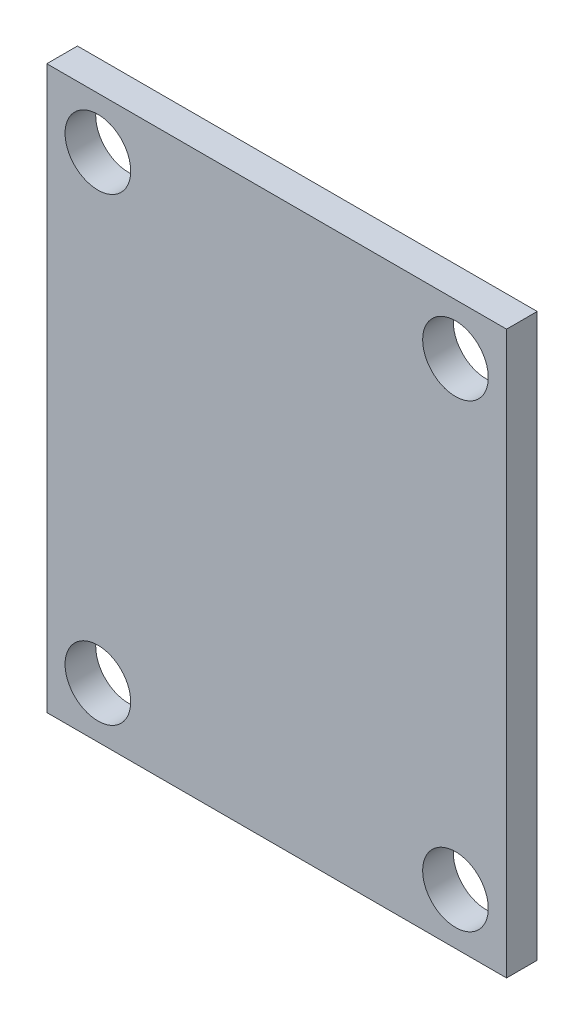
ISO-10303-21;
HEADER;
FILE_DESCRIPTION(('STEP AP214'),'2;1');
FILE_NAME('part.step','',(''),(''),'','','');
FILE_SCHEMA(('AUTOMOTIVE_DESIGN { 1 0 10303 214 1 1 1 1 }'));
ENDSEC;
DATA;
#1=APPLICATION_CONTEXT('core data for automotive mechanical design processes');
#2=APPLICATION_PROTOCOL_DEFINITION('international standard','automotive_design',2000,#1);
#3=PRODUCT_CONTEXT('',#1,'mechanical');
#4=PRODUCT('Part','Part','',(#3));
#5=PRODUCT_RELATED_PRODUCT_CATEGORY('part','',(#4));
#6=PRODUCT_DEFINITION_FORMATION('','',#4);
#7=PRODUCT_DEFINITION_CONTEXT('part definition',#1,'design');
#8=PRODUCT_DEFINITION('design','',#6,#7);
#9=PRODUCT_DEFINITION_SHAPE('','',#8);
#10=(LENGTH_UNIT() NAMED_UNIT(*) SI_UNIT(.MILLI.,.METRE.));
#11=(NAMED_UNIT(*) PLANE_ANGLE_UNIT() SI_UNIT($,.RADIAN.));
#12=(NAMED_UNIT(*) SI_UNIT($,.STERADIAN.) SOLID_ANGLE_UNIT());
#13=UNCERTAINTY_MEASURE_WITH_UNIT(LENGTH_MEASURE(1.E-05),#10,'distance_accuracy_value','');
#14=(GEOMETRIC_REPRESENTATION_CONTEXT(3) GLOBAL_UNCERTAINTY_ASSIGNED_CONTEXT((#13)) GLOBAL_UNIT_ASSIGNED_CONTEXT((#10,
#11,#12)) REPRESENTATION_CONTEXT('',''));
#15=CARTESIAN_POINT('',(0.,0.,0.));
#16=DIRECTION('',(0.,0.,1.));
#17=DIRECTION('',(1.,0.,0.));
#18=AXIS2_PLACEMENT_3D('',#15,#16,#17);
#19=CARTESIAN_POINT('',(11.43,-13.97,-1.524));
#20=DIRECTION('',(0.,0.,-1.));
#21=DIRECTION('',(1.,0.,0.));
#22=AXIS2_PLACEMENT_3D('',#19,#20,#21);
#23=PLANE('',#22);
#24=CARTESIAN_POINT('',(8.89,-11.43,-1.524));
#25=DIRECTION('',(0.,0.,1.));
#26=DIRECTION('',(1.,0.,0.));
#27=AXIS2_PLACEMENT_3D('',#24,#25,#26);
#28=CIRCLE('',#27,1.63195);
#29=CARTESIAN_POINT('',(7.25805,-11.43,-1.524));
#30=VERTEX_POINT('',#29);
#31=EDGE_CURVE('E117',#30,#30,#28,.T.);
#32=ORIENTED_EDGE('',*,*,#31,.T.);
#33=EDGE_LOOP('',(#32));
#34=FACE_BOUND('',#33,.T.);
#35=CARTESIAN_POINT('',(-8.89,11.43,-1.524));
#36=DIRECTION('',(0.,0.,1.));
#37=DIRECTION('',(1.,0.,0.));
#38=AXIS2_PLACEMENT_3D('',#35,#36,#37);
#39=CIRCLE('',#38,1.63195);
#40=CARTESIAN_POINT('',(-10.52195,11.43,-1.524));
#41=VERTEX_POINT('',#40);
#42=EDGE_CURVE('E100',#41,#41,#39,.T.);
#43=ORIENTED_EDGE('',*,*,#42,.T.);
#44=EDGE_LOOP('',(#43));
#45=FACE_BOUND('',#44,.T.);
#46=DIRECTION('',(0.,1.,0.));
#47=VECTOR('',#46,1.);
#48=CARTESIAN_POINT('',(11.43,13.97,-1.524));
#49=LINE('',#48,#47);
#50=CARTESIAN_POINT('',(11.43,-13.97,-1.524));
#51=VERTEX_POINT('',#50);
#52=CARTESIAN_POINT('',(11.43,13.97,-1.524));
#53=VERTEX_POINT('',#52);
#54=EDGE_CURVE('E88',#51,#53,#49,.T.);
#55=ORIENTED_EDGE('',*,*,#54,.F.);
#56=DIRECTION('',(1.,0.,0.));
#57=VECTOR('',#56,1.);
#58=CARTESIAN_POINT('',(-11.43,-13.97,-1.524));
#59=LINE('',#58,#57);
#60=CARTESIAN_POINT('',(-11.43,-13.97,-1.524));
#61=VERTEX_POINT('',#60);
#62=EDGE_CURVE('E91',#61,#51,#59,.T.);
#63=ORIENTED_EDGE('',*,*,#62,.F.);
#64=DIRECTION('',(0.,-1.,0.));
#65=VECTOR('',#64,1.);
#66=CARTESIAN_POINT('',(-11.43,13.97,-1.524));
#67=LINE('',#66,#65);
#68=CARTESIAN_POINT('',(-11.43,13.97,-1.524));
#69=VERTEX_POINT('',#68);
#70=EDGE_CURVE('E79',#69,#61,#67,.T.);
#71=ORIENTED_EDGE('',*,*,#70,.F.);
#72=DIRECTION('',(-1.,0.,0.));
#73=VECTOR('',#72,1.);
#74=CARTESIAN_POINT('',(-11.43,13.97,-1.524));
#75=LINE('',#74,#73);
#76=EDGE_CURVE('E84',#53,#69,#75,.T.);
#77=ORIENTED_EDGE('',*,*,#76,.F.);
#78=EDGE_LOOP('',(#55,#63,#71,#77));
#79=FACE_BOUND('',#78,.T.);
#80=CARTESIAN_POINT('',(8.89,11.43,-1.524));
#81=DIRECTION('',(0.,0.,1.));
#82=DIRECTION('',(1.,0.,0.));
#83=AXIS2_PLACEMENT_3D('',#80,#81,#82);
#84=CIRCLE('',#83,1.63195);
#85=CARTESIAN_POINT('',(7.25805,11.43,-1.524));
#86=VERTEX_POINT('',#85);
#87=EDGE_CURVE('E111',#86,#86,#84,.T.);
#88=ORIENTED_EDGE('',*,*,#87,.T.);
#89=EDGE_LOOP('',(#88));
#90=FACE_BOUND('',#89,.T.);
#91=CARTESIAN_POINT('',(-8.89,-11.43,-1.524));
#92=DIRECTION('',(0.,0.,1.));
#93=DIRECTION('',(1.,0.,0.));
#94=AXIS2_PLACEMENT_3D('',#91,#92,#93);
#95=CIRCLE('',#94,1.63195);
#96=CARTESIAN_POINT('',(-10.52195,-11.43,-1.524));
#97=VERTEX_POINT('',#96);
#98=EDGE_CURVE('E123',#97,#97,#95,.T.);
#99=ORIENTED_EDGE('',*,*,#98,.T.);
#100=EDGE_LOOP('',(#99));
#101=FACE_BOUND('',#100,.T.);
#102=ADVANCED_FACE('F32',(#34,#45,#79,#90,#101),#23,.T.);
#103=CARTESIAN_POINT('',(11.43,-13.97,0.));
#104=DIRECTION('',(0.,0.,-1.));
#105=DIRECTION('',(1.,0.,0.));
#106=AXIS2_PLACEMENT_3D('',#103,#104,#105);
#107=PLANE('',#106);
#108=CARTESIAN_POINT('',(8.89,-11.43,0.));
#109=DIRECTION('',(0.,0.,1.));
#110=DIRECTION('',(1.,0.,0.));
#111=AXIS2_PLACEMENT_3D('',#108,#109,#110);
#112=CIRCLE('',#111,1.63195);
#113=CARTESIAN_POINT('',(7.25805,-11.43,0.));
#114=VERTEX_POINT('',#113);
#115=EDGE_CURVE('E120',#114,#114,#112,.T.);
#116=ORIENTED_EDGE('',*,*,#115,.F.);
#117=EDGE_LOOP('',(#116));
#118=FACE_BOUND('',#117,.T.);
#119=CARTESIAN_POINT('',(-8.89,11.43,0.));
#120=DIRECTION('',(0.,0.,1.));
#121=DIRECTION('',(1.,0.,0.));
#122=AXIS2_PLACEMENT_3D('',#119,#120,#121);
#123=CIRCLE('',#122,1.63195);
#124=CARTESIAN_POINT('',(-10.52195,11.43,0.));
#125=VERTEX_POINT('',#124);
#126=EDGE_CURVE('E108',#125,#125,#123,.T.);
#127=ORIENTED_EDGE('',*,*,#126,.F.);
#128=EDGE_LOOP('',(#127));
#129=FACE_BOUND('',#128,.T.);
#130=DIRECTION('',(0.,1.,0.));
#131=VECTOR('',#130,1.);
#132=CARTESIAN_POINT('',(11.43,13.97,0.));
#133=LINE('',#132,#131);
#134=CARTESIAN_POINT('',(11.43,-13.97,0.));
#135=VERTEX_POINT('',#134);
#136=CARTESIAN_POINT('',(11.43,13.97,0.));
#137=VERTEX_POINT('',#136);
#138=EDGE_CURVE('E96',#135,#137,#133,.T.);
#139=ORIENTED_EDGE('',*,*,#138,.T.);
#140=DIRECTION('',(-1.,0.,0.));
#141=VECTOR('',#140,1.);
#142=CARTESIAN_POINT('',(-11.43,13.97,0.));
#143=LINE('',#142,#141);
#144=CARTESIAN_POINT('',(-11.43,13.97,0.));
#145=VERTEX_POINT('',#144);
#146=EDGE_CURVE('E99',#137,#145,#143,.T.);
#147=ORIENTED_EDGE('',*,*,#146,.T.);
#148=DIRECTION('',(0.,-1.,0.));
#149=VECTOR('',#148,1.);
#150=CARTESIAN_POINT('',(-11.43,13.97,0.));
#151=LINE('',#150,#149);
#152=CARTESIAN_POINT('',(-11.43,-13.97,0.));
#153=VERTEX_POINT('',#152);
#154=EDGE_CURVE('E82',#145,#153,#151,.T.);
#155=ORIENTED_EDGE('',*,*,#154,.T.);
#156=DIRECTION('',(1.,0.,0.));
#157=VECTOR('',#156,1.);
#158=CARTESIAN_POINT('',(-11.43,-13.97,0.));
#159=LINE('',#158,#157);
#160=EDGE_CURVE('E103',#153,#135,#159,.T.);
#161=ORIENTED_EDGE('',*,*,#160,.T.);
#162=EDGE_LOOP('',(#139,#147,#155,#161));
#163=FACE_BOUND('',#162,.T.);
#164=CARTESIAN_POINT('',(8.89,11.43,0.));
#165=DIRECTION('',(0.,0.,1.));
#166=DIRECTION('',(1.,0.,0.));
#167=AXIS2_PLACEMENT_3D('',#164,#165,#166);
#168=CIRCLE('',#167,1.63195);
#169=CARTESIAN_POINT('',(7.25805,11.43,0.));
#170=VERTEX_POINT('',#169);
#171=EDGE_CURVE('E114',#170,#170,#168,.T.);
#172=ORIENTED_EDGE('',*,*,#171,.F.);
#173=EDGE_LOOP('',(#172));
#174=FACE_BOUND('',#173,.T.);
#175=CARTESIAN_POINT('',(-8.89,-11.43,0.));
#176=DIRECTION('',(0.,0.,1.));
#177=DIRECTION('',(1.,0.,0.));
#178=AXIS2_PLACEMENT_3D('',#175,#176,#177);
#179=CIRCLE('',#178,1.63195);
#180=CARTESIAN_POINT('',(-10.52195,-11.43,0.));
#181=VERTEX_POINT('',#180);
#182=EDGE_CURVE('E126',#181,#181,#179,.T.);
#183=ORIENTED_EDGE('',*,*,#182,.F.);
#184=EDGE_LOOP('',(#183));
#185=FACE_BOUND('',#184,.T.);
#186=ADVANCED_FACE('F140',(#118,#129,#163,#174,#185),#107,.F.);
#187=CARTESIAN_POINT('',(11.43,13.97,-1.524));
#188=DIRECTION('',(-1.,0.,0.));
#189=DIRECTION('',(0.,-1.,0.));
#190=AXIS2_PLACEMENT_3D('',#187,#188,#189);
#191=PLANE('',#190);
#192=ORIENTED_EDGE('',*,*,#138,.F.);
#193=DIRECTION('',(0.,0.,1.));
#194=VECTOR('',#193,1.);
#195=CARTESIAN_POINT('',(11.43,-13.97,-1.524));
#196=LINE('',#195,#194);
#197=EDGE_CURVE('E49',#51,#135,#196,.T.);
#198=ORIENTED_EDGE('',*,*,#197,.F.);
#199=ORIENTED_EDGE('',*,*,#54,.T.);
#200=DIRECTION('',(0.,0.,1.));
#201=VECTOR('',#200,1.);
#202=CARTESIAN_POINT('',(11.43,13.97,-1.524));
#203=LINE('',#202,#201);
#204=EDGE_CURVE('E11',#53,#137,#203,.T.);
#205=ORIENTED_EDGE('',*,*,#204,.T.);
#206=EDGE_LOOP('',(#192,#198,#199,#205));
#207=FACE_BOUND('',#206,.T.);
#208=ADVANCED_FACE('F34',(#207),#191,.F.);
#209=CARTESIAN_POINT('',(-11.43,13.97,-1.524));
#210=DIRECTION('',(0.,-1.,0.));
#211=DIRECTION('',(0.,0.,1.));
#212=AXIS2_PLACEMENT_3D('',#209,#210,#211);
#213=PLANE('',#212);
#214=ORIENTED_EDGE('',*,*,#146,.F.);
#215=ORIENTED_EDGE('',*,*,#204,.F.);
#216=ORIENTED_EDGE('',*,*,#76,.T.);
#217=DIRECTION('',(0.,0.,1.));
#218=VECTOR('',#217,1.);
#219=CARTESIAN_POINT('',(-11.43,13.97,-1.524));
#220=LINE('',#219,#218);
#221=EDGE_CURVE('E41',#69,#145,#220,.T.);
#222=ORIENTED_EDGE('',*,*,#221,.T.);
#223=EDGE_LOOP('',(#214,#215,#216,#222));
#224=FACE_BOUND('',#223,.T.);
#225=ADVANCED_FACE('F85',(#224),#213,.F.);
#226=CARTESIAN_POINT('',(-11.43,13.97,-1.524));
#227=DIRECTION('',(1.,0.,0.));
#228=DIRECTION('',(0.,0.,1.));
#229=AXIS2_PLACEMENT_3D('',#226,#227,#228);
#230=PLANE('',#229);
#231=ORIENTED_EDGE('',*,*,#154,.F.);
#232=ORIENTED_EDGE('',*,*,#221,.F.);
#233=ORIENTED_EDGE('',*,*,#70,.T.);
#234=DIRECTION('',(0.,0.,1.));
#235=VECTOR('',#234,1.);
#236=CARTESIAN_POINT('',(-11.43,-13.97,-1.524));
#237=LINE('',#236,#235);
#238=EDGE_CURVE('E65',#61,#153,#237,.T.);
#239=ORIENTED_EDGE('',*,*,#238,.T.);
#240=EDGE_LOOP('',(#231,#232,#233,#239));
#241=FACE_BOUND('',#240,.T.);
#242=ADVANCED_FACE('F77',(#241),#230,.F.);
#243=CARTESIAN_POINT('',(-11.43,-13.97,-1.524));
#244=DIRECTION('',(0.,1.,0.));
#245=DIRECTION('',(0.,0.,-1.));
#246=AXIS2_PLACEMENT_3D('',#243,#244,#245);
#247=PLANE('',#246);
#248=ORIENTED_EDGE('',*,*,#160,.F.);
#249=ORIENTED_EDGE('',*,*,#238,.F.);
#250=ORIENTED_EDGE('',*,*,#62,.T.);
#251=ORIENTED_EDGE('',*,*,#197,.T.);
#252=EDGE_LOOP('',(#248,#249,#250,#251));
#253=FACE_BOUND('',#252,.T.);
#254=ADVANCED_FACE('F154',(#253),#247,.F.);
#255=CARTESIAN_POINT('',(-8.89,11.43,-1.524));
#256=DIRECTION('',(0.,0.,1.));
#257=DIRECTION('',(-1.,0.,0.));
#258=AXIS2_PLACEMENT_3D('',#255,#256,#257);
#259=CYLINDRICAL_SURFACE('',#258,1.63195);
#260=CARTESIAN_POINT('',(-10.52195,11.43,-1.524));
#261=CARTESIAN_POINT('',(-10.52195,11.43,-1.508125));
#262=CARTESIAN_POINT('',(-10.52195,11.43,-1.49225));
#263=CARTESIAN_POINT('',(-10.52195,11.43,-1.4605));
#264=CARTESIAN_POINT('',(-10.52195,11.43,-1.444625));
#265=CARTESIAN_POINT('',(-10.52195,11.43,-1.412875));
#266=CARTESIAN_POINT('',(-10.52195,11.43,-1.397));
#267=CARTESIAN_POINT('',(-10.52195,11.43,-1.36525));
#268=CARTESIAN_POINT('',(-10.52195,11.43,-1.349375));
#269=CARTESIAN_POINT('',(-10.52195,11.43,-1.317625));
#270=CARTESIAN_POINT('',(-10.52195,11.43,-1.30175));
#271=CARTESIAN_POINT('',(-10.52195,11.43,-1.27));
#272=CARTESIAN_POINT('',(-10.52195,11.43,-1.254125));
#273=CARTESIAN_POINT('',(-10.52195,11.43,-1.222375));
#274=CARTESIAN_POINT('',(-10.52195,11.43,-1.2065));
#275=CARTESIAN_POINT('',(-10.52195,11.43,-1.17475));
#276=CARTESIAN_POINT('',(-10.52195,11.43,-1.158875));
#277=CARTESIAN_POINT('',(-10.52195,11.43,-1.127125));
#278=CARTESIAN_POINT('',(-10.52195,11.43,-1.11125));
#279=CARTESIAN_POINT('',(-10.52195,11.43,-1.0795));
#280=CARTESIAN_POINT('',(-10.52195,11.43,-1.063625));
#281=CARTESIAN_POINT('',(-10.52195,11.43,-1.031875));
#282=CARTESIAN_POINT('',(-10.52195,11.43,-1.016));
#283=CARTESIAN_POINT('',(-10.52195,11.43,-0.98425));
#284=CARTESIAN_POINT('',(-10.52195,11.43,-0.968375));
#285=CARTESIAN_POINT('',(-10.52195,11.43,-0.936625));
#286=CARTESIAN_POINT('',(-10.52195,11.43,-0.92075));
#287=CARTESIAN_POINT('',(-10.52195,11.43,-0.889));
#288=CARTESIAN_POINT('',(-10.52195,11.43,-0.873125));
#289=CARTESIAN_POINT('',(-10.52195,11.43,-0.841375));
#290=CARTESIAN_POINT('',(-10.52195,11.43,-0.8255));
#291=CARTESIAN_POINT('',(-10.52195,11.43,-0.79375));
#292=CARTESIAN_POINT('',(-10.52195,11.43,-0.777875));
#293=CARTESIAN_POINT('',(-10.52195,11.43,-0.746125));
#294=CARTESIAN_POINT('',(-10.52195,11.43,-0.73025));
#295=CARTESIAN_POINT('',(-10.52195,11.43,-0.6985));
#296=CARTESIAN_POINT('',(-10.52195,11.43,-0.682625));
#297=CARTESIAN_POINT('',(-10.52195,11.43,-0.650875));
#298=CARTESIAN_POINT('',(-10.52195,11.43,-0.635));
#299=CARTESIAN_POINT('',(-10.52195,11.43,-0.60325));
#300=CARTESIAN_POINT('',(-10.52195,11.43,-0.587375));
#301=CARTESIAN_POINT('',(-10.52195,11.43,-0.555625));
#302=CARTESIAN_POINT('',(-10.52195,11.43,-0.53975));
#303=CARTESIAN_POINT('',(-10.52195,11.43,-0.508));
#304=CARTESIAN_POINT('',(-10.52195,11.43,-0.492125));
#305=CARTESIAN_POINT('',(-10.52195,11.43,-0.460375));
#306=CARTESIAN_POINT('',(-10.52195,11.43,-0.4445));
#307=CARTESIAN_POINT('',(-10.52195,11.43,-0.41275));
#308=CARTESIAN_POINT('',(-10.52195,11.43,-0.396875));
#309=CARTESIAN_POINT('',(-10.52195,11.43,-0.365125));
#310=CARTESIAN_POINT('',(-10.52195,11.43,-0.34925));
#311=CARTESIAN_POINT('',(-10.52195,11.43,-0.3175));
#312=CARTESIAN_POINT('',(-10.52195,11.43,-0.301625));
#313=CARTESIAN_POINT('',(-10.52195,11.43,-0.269875));
#314=CARTESIAN_POINT('',(-10.52195,11.43,-0.254));
#315=CARTESIAN_POINT('',(-10.52195,11.43,-0.22225));
#316=CARTESIAN_POINT('',(-10.52195,11.43,-0.206375));
#317=CARTESIAN_POINT('',(-10.52195,11.43,-0.174625));
#318=CARTESIAN_POINT('',(-10.52195,11.43,-0.15875));
#319=CARTESIAN_POINT('',(-10.52195,11.43,-0.127));
#320=CARTESIAN_POINT('',(-10.52195,11.43,-0.111125));
#321=CARTESIAN_POINT('',(-10.52195,11.43,-0.079375));
#322=CARTESIAN_POINT('',(-10.52195,11.43,-0.0635));
#323=CARTESIAN_POINT('',(-10.52195,11.43,-0.0317499999999999));
#324=CARTESIAN_POINT('',(-10.52195,11.43,-0.015875));
#325=CARTESIAN_POINT('',(-10.52195,11.43,0.));
#326=B_SPLINE_CURVE_WITH_KNOTS('',3,(#260,#261,#262,#263,#264,#265,#266,#267,#268,#269,#270,
#271,#272,#273,#274,#275,#276,#277,#278,#279,#280,#281,#282,#283,#284,#285,#286,#287,#288,#289,
#290,#291,#292,#293,#294,#295,#296,#297,#298,#299,#300,#301,#302,#303,#304,#305,#306,#307,#308,
#309,#310,#311,#312,#313,#314,#315,#316,#317,#318,#319,#320,#321,#322,#323,#324,#325),
.UNSPECIFIED.,.F.,.F.,(4,2,2,2,2,2,2,2,2,2,2,2,2,2,2,2,2,2,2,2,2,2,2,2,2,2,2,2,2,2,2,2,4),(0.,
0.0476249999999999,0.0952499999999998,0.142875,0.1905,0.238125,0.28575,0.333375,0.381,0.428625,
0.47625,0.523875,0.5715,0.619125,0.66675,0.714375,0.762,0.809625,0.85725,0.904875,0.9525,
1.000125,1.04775,1.095375,1.143,1.190625,1.23825,1.285875,1.3335,1.381125,1.42875,1.476375,
1.524),.UNSPECIFIED.);
#327=EDGE_CURVE('BSEAM157',#41,#125,#326,.T.);
#328=ORIENTED_EDGE('',*,*,#42,.F.);
#329=ORIENTED_EDGE('',*,*,#126,.T.);
#330=ORIENTED_EDGE('',*,*,#327,.T.);
#331=ORIENTED_EDGE('',*,*,#327,.F.);
#332=EDGE_LOOP('',(#328,#330,#329,#331));
#333=FACE_BOUND('',#332,.T.);
#334=ADVANCED_FACE('F157',(#333),#259,.F.);
#335=CARTESIAN_POINT('',(8.89,11.43,-1.524));
#336=DIRECTION('',(0.,0.,1.));
#337=DIRECTION('',(-1.,0.,0.));
#338=AXIS2_PLACEMENT_3D('',#335,#336,#337);
#339=CYLINDRICAL_SURFACE('',#338,1.63195);
#340=CARTESIAN_POINT('',(7.25805,11.43,-1.524));
#341=CARTESIAN_POINT('',(7.25805,11.43,-1.508125));
#342=CARTESIAN_POINT('',(7.25805,11.43,-1.49225));
#343=CARTESIAN_POINT('',(7.25805,11.43,-1.4605));
#344=CARTESIAN_POINT('',(7.25805,11.43,-1.444625));
#345=CARTESIAN_POINT('',(7.25805,11.43,-1.412875));
#346=CARTESIAN_POINT('',(7.25805,11.43,-1.397));
#347=CARTESIAN_POINT('',(7.25805,11.43,-1.36525));
#348=CARTESIAN_POINT('',(7.25805,11.43,-1.349375));
#349=CARTESIAN_POINT('',(7.25805,11.43,-1.317625));
#350=CARTESIAN_POINT('',(7.25805,11.43,-1.30175));
#351=CARTESIAN_POINT('',(7.25805,11.43,-1.27));
#352=CARTESIAN_POINT('',(7.25805,11.43,-1.254125));
#353=CARTESIAN_POINT('',(7.25805,11.43,-1.222375));
#354=CARTESIAN_POINT('',(7.25805,11.43,-1.2065));
#355=CARTESIAN_POINT('',(7.25805,11.43,-1.17475));
#356=CARTESIAN_POINT('',(7.25805,11.43,-1.158875));
#357=CARTESIAN_POINT('',(7.25805,11.43,-1.127125));
#358=CARTESIAN_POINT('',(7.25805,11.43,-1.11125));
#359=CARTESIAN_POINT('',(7.25805,11.43,-1.0795));
#360=CARTESIAN_POINT('',(7.25805,11.43,-1.063625));
#361=CARTESIAN_POINT('',(7.25805,11.43,-1.031875));
#362=CARTESIAN_POINT('',(7.25805,11.43,-1.016));
#363=CARTESIAN_POINT('',(7.25805,11.43,-0.98425));
#364=CARTESIAN_POINT('',(7.25805,11.43,-0.968375));
#365=CARTESIAN_POINT('',(7.25805,11.43,-0.936625));
#366=CARTESIAN_POINT('',(7.25805,11.43,-0.92075));
#367=CARTESIAN_POINT('',(7.25805,11.43,-0.889));
#368=CARTESIAN_POINT('',(7.25805,11.43,-0.873125));
#369=CARTESIAN_POINT('',(7.25805,11.43,-0.841375));
#370=CARTESIAN_POINT('',(7.25805,11.43,-0.8255));
#371=CARTESIAN_POINT('',(7.25805,11.43,-0.79375));
#372=CARTESIAN_POINT('',(7.25805,11.43,-0.777875));
#373=CARTESIAN_POINT('',(7.25805,11.43,-0.746125));
#374=CARTESIAN_POINT('',(7.25805,11.43,-0.73025));
#375=CARTESIAN_POINT('',(7.25805,11.43,-0.6985));
#376=CARTESIAN_POINT('',(7.25805,11.43,-0.682625));
#377=CARTESIAN_POINT('',(7.25805,11.43,-0.650875));
#378=CARTESIAN_POINT('',(7.25805,11.43,-0.635));
#379=CARTESIAN_POINT('',(7.25805,11.43,-0.60325));
#380=CARTESIAN_POINT('',(7.25805,11.43,-0.587375));
#381=CARTESIAN_POINT('',(7.25805,11.43,-0.555625));
#382=CARTESIAN_POINT('',(7.25805,11.43,-0.53975));
#383=CARTESIAN_POINT('',(7.25805,11.43,-0.508));
#384=CARTESIAN_POINT('',(7.25805,11.43,-0.492125));
#385=CARTESIAN_POINT('',(7.25805,11.43,-0.460375));
#386=CARTESIAN_POINT('',(7.25805,11.43,-0.4445));
#387=CARTESIAN_POINT('',(7.25805,11.43,-0.41275));
#388=CARTESIAN_POINT('',(7.25805,11.43,-0.396875));
#389=CARTESIAN_POINT('',(7.25805,11.43,-0.365125));
#390=CARTESIAN_POINT('',(7.25805,11.43,-0.34925));
#391=CARTESIAN_POINT('',(7.25805,11.43,-0.3175));
#392=CARTESIAN_POINT('',(7.25805,11.43,-0.301625));
#393=CARTESIAN_POINT('',(7.25805,11.43,-0.269875));
#394=CARTESIAN_POINT('',(7.25805,11.43,-0.254));
#395=CARTESIAN_POINT('',(7.25805,11.43,-0.22225));
#396=CARTESIAN_POINT('',(7.25805,11.43,-0.206375));
#397=CARTESIAN_POINT('',(7.25805,11.43,-0.174625));
#398=CARTESIAN_POINT('',(7.25805,11.43,-0.15875));
#399=CARTESIAN_POINT('',(7.25805,11.43,-0.127));
#400=CARTESIAN_POINT('',(7.25805,11.43,-0.111125));
#401=CARTESIAN_POINT('',(7.25805,11.43,-0.079375));
#402=CARTESIAN_POINT('',(7.25805,11.43,-0.0635));
#403=CARTESIAN_POINT('',(7.25805,11.43,-0.0317499999999999));
#404=CARTESIAN_POINT('',(7.25805,11.43,-0.015875));
#405=CARTESIAN_POINT('',(7.25805,11.43,0.));
#406=B_SPLINE_CURVE_WITH_KNOTS('',3,(#340,#341,#342,#343,#344,#345,#346,#347,#348,#349,#350,
#351,#352,#353,#354,#355,#356,#357,#358,#359,#360,#361,#362,#363,#364,#365,#366,#367,#368,#369,
#370,#371,#372,#373,#374,#375,#376,#377,#378,#379,#380,#381,#382,#383,#384,#385,#386,#387,#388,
#389,#390,#391,#392,#393,#394,#395,#396,#397,#398,#399,#400,#401,#402,#403,#404,#405),
.UNSPECIFIED.,.F.,.F.,(4,2,2,2,2,2,2,2,2,2,2,2,2,2,2,2,2,2,2,2,2,2,2,2,2,2,2,2,2,2,2,2,4),(0.,
0.0476249999999999,0.0952499999999998,0.142875,0.1905,0.238125,0.28575,0.333375,0.381,0.428625,
0.47625,0.523875,0.5715,0.619125,0.66675,0.714375,0.762,0.809625,0.85725,0.904875,0.9525,
1.000125,1.04775,1.095375,1.143,1.190625,1.23825,1.285875,1.3335,1.381125,1.42875,1.476375,
1.524),.UNSPECIFIED.);
#407=EDGE_CURVE('BSEAM178',#86,#170,#406,.T.);
#408=ORIENTED_EDGE('',*,*,#87,.F.);
#409=ORIENTED_EDGE('',*,*,#171,.T.);
#410=ORIENTED_EDGE('',*,*,#407,.T.);
#411=ORIENTED_EDGE('',*,*,#407,.F.);
#412=EDGE_LOOP('',(#408,#410,#409,#411));
#413=FACE_BOUND('',#412,.T.);
#414=ADVANCED_FACE('F178',(#413),#339,.F.);
#415=CARTESIAN_POINT('',(8.89,-11.43,-1.524));
#416=DIRECTION('',(0.,0.,1.));
#417=DIRECTION('',(-1.,0.,0.));
#418=AXIS2_PLACEMENT_3D('',#415,#416,#417);
#419=CYLINDRICAL_SURFACE('',#418,1.63195);
#420=CARTESIAN_POINT('',(7.25805,-11.43,-1.524));
#421=CARTESIAN_POINT('',(7.25805,-11.43,-1.508125));
#422=CARTESIAN_POINT('',(7.25805,-11.43,-1.49225));
#423=CARTESIAN_POINT('',(7.25805,-11.43,-1.4605));
#424=CARTESIAN_POINT('',(7.25805,-11.43,-1.444625));
#425=CARTESIAN_POINT('',(7.25805,-11.43,-1.412875));
#426=CARTESIAN_POINT('',(7.25805,-11.43,-1.397));
#427=CARTESIAN_POINT('',(7.25805,-11.43,-1.36525));
#428=CARTESIAN_POINT('',(7.25805,-11.43,-1.349375));
#429=CARTESIAN_POINT('',(7.25805,-11.43,-1.317625));
#430=CARTESIAN_POINT('',(7.25805,-11.43,-1.30175));
#431=CARTESIAN_POINT('',(7.25805,-11.43,-1.27));
#432=CARTESIAN_POINT('',(7.25805,-11.43,-1.254125));
#433=CARTESIAN_POINT('',(7.25805,-11.43,-1.222375));
#434=CARTESIAN_POINT('',(7.25805,-11.43,-1.2065));
#435=CARTESIAN_POINT('',(7.25805,-11.43,-1.17475));
#436=CARTESIAN_POINT('',(7.25805,-11.43,-1.158875));
#437=CARTESIAN_POINT('',(7.25805,-11.43,-1.127125));
#438=CARTESIAN_POINT('',(7.25805,-11.43,-1.11125));
#439=CARTESIAN_POINT('',(7.25805,-11.43,-1.0795));
#440=CARTESIAN_POINT('',(7.25805,-11.43,-1.063625));
#441=CARTESIAN_POINT('',(7.25805,-11.43,-1.031875));
#442=CARTESIAN_POINT('',(7.25805,-11.43,-1.016));
#443=CARTESIAN_POINT('',(7.25805,-11.43,-0.98425));
#444=CARTESIAN_POINT('',(7.25805,-11.43,-0.968375));
#445=CARTESIAN_POINT('',(7.25805,-11.43,-0.936625));
#446=CARTESIAN_POINT('',(7.25805,-11.43,-0.92075));
#447=CARTESIAN_POINT('',(7.25805,-11.43,-0.889));
#448=CARTESIAN_POINT('',(7.25805,-11.43,-0.873125));
#449=CARTESIAN_POINT('',(7.25805,-11.43,-0.841375));
#450=CARTESIAN_POINT('',(7.25805,-11.43,-0.8255));
#451=CARTESIAN_POINT('',(7.25805,-11.43,-0.79375));
#452=CARTESIAN_POINT('',(7.25805,-11.43,-0.777875));
#453=CARTESIAN_POINT('',(7.25805,-11.43,-0.746125));
#454=CARTESIAN_POINT('',(7.25805,-11.43,-0.73025));
#455=CARTESIAN_POINT('',(7.25805,-11.43,-0.6985));
#456=CARTESIAN_POINT('',(7.25805,-11.43,-0.682625));
#457=CARTESIAN_POINT('',(7.25805,-11.43,-0.650875));
#458=CARTESIAN_POINT('',(7.25805,-11.43,-0.635));
#459=CARTESIAN_POINT('',(7.25805,-11.43,-0.60325));
#460=CARTESIAN_POINT('',(7.25805,-11.43,-0.587375));
#461=CARTESIAN_POINT('',(7.25805,-11.43,-0.555625));
#462=CARTESIAN_POINT('',(7.25805,-11.43,-0.53975));
#463=CARTESIAN_POINT('',(7.25805,-11.43,-0.508));
#464=CARTESIAN_POINT('',(7.25805,-11.43,-0.492125));
#465=CARTESIAN_POINT('',(7.25805,-11.43,-0.460375));
#466=CARTESIAN_POINT('',(7.25805,-11.43,-0.4445));
#467=CARTESIAN_POINT('',(7.25805,-11.43,-0.41275));
#468=CARTESIAN_POINT('',(7.25805,-11.43,-0.396875));
#469=CARTESIAN_POINT('',(7.25805,-11.43,-0.365125));
#470=CARTESIAN_POINT('',(7.25805,-11.43,-0.34925));
#471=CARTESIAN_POINT('',(7.25805,-11.43,-0.3175));
#472=CARTESIAN_POINT('',(7.25805,-11.43,-0.301625));
#473=CARTESIAN_POINT('',(7.25805,-11.43,-0.269875));
#474=CARTESIAN_POINT('',(7.25805,-11.43,-0.254));
#475=CARTESIAN_POINT('',(7.25805,-11.43,-0.22225));
#476=CARTESIAN_POINT('',(7.25805,-11.43,-0.206375));
#477=CARTESIAN_POINT('',(7.25805,-11.43,-0.174625));
#478=CARTESIAN_POINT('',(7.25805,-11.43,-0.15875));
#479=CARTESIAN_POINT('',(7.25805,-11.43,-0.127));
#480=CARTESIAN_POINT('',(7.25805,-11.43,-0.111125));
#481=CARTESIAN_POINT('',(7.25805,-11.43,-0.079375));
#482=CARTESIAN_POINT('',(7.25805,-11.43,-0.0635));
#483=CARTESIAN_POINT('',(7.25805,-11.43,-0.0317499999999999));
#484=CARTESIAN_POINT('',(7.25805,-11.43,-0.015875));
#485=CARTESIAN_POINT('',(7.25805,-11.43,0.));
#486=B_SPLINE_CURVE_WITH_KNOTS('',3,(#420,#421,#422,#423,#424,#425,#426,#427,#428,#429,#430,
#431,#432,#433,#434,#435,#436,#437,#438,#439,#440,#441,#442,#443,#444,#445,#446,#447,#448,#449,
#450,#451,#452,#453,#454,#455,#456,#457,#458,#459,#460,#461,#462,#463,#464,#465,#466,#467,#468,
#469,#470,#471,#472,#473,#474,#475,#476,#477,#478,#479,#480,#481,#482,#483,#484,#485),
.UNSPECIFIED.,.F.,.F.,(4,2,2,2,2,2,2,2,2,2,2,2,2,2,2,2,2,2,2,2,2,2,2,2,2,2,2,2,2,2,2,2,4),(0.,
0.0476249999999999,0.0952499999999998,0.142875,0.1905,0.238125,0.28575,0.333375,0.381,0.428625,
0.47625,0.523875,0.5715,0.619125,0.66675,0.714375,0.762,0.809625,0.85725,0.904875,0.9525,
1.000125,1.04775,1.095375,1.143,1.190625,1.23825,1.285875,1.3335,1.381125,1.42875,1.476375,
1.524),.UNSPECIFIED.);
#487=EDGE_CURVE('BSEAM136',#30,#114,#486,.T.);
#488=ORIENTED_EDGE('',*,*,#31,.F.);
#489=ORIENTED_EDGE('',*,*,#115,.T.);
#490=ORIENTED_EDGE('',*,*,#487,.T.);
#491=ORIENTED_EDGE('',*,*,#487,.F.);
#492=EDGE_LOOP('',(#488,#490,#489,#491));
#493=FACE_BOUND('',#492,.T.);
#494=ADVANCED_FACE('F136',(#493),#419,.F.);
#495=CARTESIAN_POINT('',(-8.89,-11.43,-1.524));
#496=DIRECTION('',(0.,0.,1.));
#497=DIRECTION('',(-1.,0.,0.));
#498=AXIS2_PLACEMENT_3D('',#495,#496,#497);
#499=CYLINDRICAL_SURFACE('',#498,1.63195);
#500=CARTESIAN_POINT('',(-10.52195,-11.43,-1.524));
#501=CARTESIAN_POINT('',(-10.52195,-11.43,-1.508125));
#502=CARTESIAN_POINT('',(-10.52195,-11.43,-1.49225));
#503=CARTESIAN_POINT('',(-10.52195,-11.43,-1.4605));
#504=CARTESIAN_POINT('',(-10.52195,-11.43,-1.444625));
#505=CARTESIAN_POINT('',(-10.52195,-11.43,-1.412875));
#506=CARTESIAN_POINT('',(-10.52195,-11.43,-1.397));
#507=CARTESIAN_POINT('',(-10.52195,-11.43,-1.36525));
#508=CARTESIAN_POINT('',(-10.52195,-11.43,-1.349375));
#509=CARTESIAN_POINT('',(-10.52195,-11.43,-1.317625));
#510=CARTESIAN_POINT('',(-10.52195,-11.43,-1.30175));
#511=CARTESIAN_POINT('',(-10.52195,-11.43,-1.27));
#512=CARTESIAN_POINT('',(-10.52195,-11.43,-1.254125));
#513=CARTESIAN_POINT('',(-10.52195,-11.43,-1.222375));
#514=CARTESIAN_POINT('',(-10.52195,-11.43,-1.2065));
#515=CARTESIAN_POINT('',(-10.52195,-11.43,-1.17475));
#516=CARTESIAN_POINT('',(-10.52195,-11.43,-1.158875));
#517=CARTESIAN_POINT('',(-10.52195,-11.43,-1.127125));
#518=CARTESIAN_POINT('',(-10.52195,-11.43,-1.11125));
#519=CARTESIAN_POINT('',(-10.52195,-11.43,-1.0795));
#520=CARTESIAN_POINT('',(-10.52195,-11.43,-1.063625));
#521=CARTESIAN_POINT('',(-10.52195,-11.43,-1.031875));
#522=CARTESIAN_POINT('',(-10.52195,-11.43,-1.016));
#523=CARTESIAN_POINT('',(-10.52195,-11.43,-0.98425));
#524=CARTESIAN_POINT('',(-10.52195,-11.43,-0.968375));
#525=CARTESIAN_POINT('',(-10.52195,-11.43,-0.936625));
#526=CARTESIAN_POINT('',(-10.52195,-11.43,-0.92075));
#527=CARTESIAN_POINT('',(-10.52195,-11.43,-0.889));
#528=CARTESIAN_POINT('',(-10.52195,-11.43,-0.873125));
#529=CARTESIAN_POINT('',(-10.52195,-11.43,-0.841375));
#530=CARTESIAN_POINT('',(-10.52195,-11.43,-0.8255));
#531=CARTESIAN_POINT('',(-10.52195,-11.43,-0.79375));
#532=CARTESIAN_POINT('',(-10.52195,-11.43,-0.777875));
#533=CARTESIAN_POINT('',(-10.52195,-11.43,-0.746125));
#534=CARTESIAN_POINT('',(-10.52195,-11.43,-0.73025));
#535=CARTESIAN_POINT('',(-10.52195,-11.43,-0.6985));
#536=CARTESIAN_POINT('',(-10.52195,-11.43,-0.682625));
#537=CARTESIAN_POINT('',(-10.52195,-11.43,-0.650875));
#538=CARTESIAN_POINT('',(-10.52195,-11.43,-0.635));
#539=CARTESIAN_POINT('',(-10.52195,-11.43,-0.60325));
#540=CARTESIAN_POINT('',(-10.52195,-11.43,-0.587375));
#541=CARTESIAN_POINT('',(-10.52195,-11.43,-0.555625));
#542=CARTESIAN_POINT('',(-10.52195,-11.43,-0.53975));
#543=CARTESIAN_POINT('',(-10.52195,-11.43,-0.508));
#544=CARTESIAN_POINT('',(-10.52195,-11.43,-0.492125));
#545=CARTESIAN_POINT('',(-10.52195,-11.43,-0.460375));
#546=CARTESIAN_POINT('',(-10.52195,-11.43,-0.4445));
#547=CARTESIAN_POINT('',(-10.52195,-11.43,-0.41275));
#548=CARTESIAN_POINT('',(-10.52195,-11.43,-0.396875));
#549=CARTESIAN_POINT('',(-10.52195,-11.43,-0.365125));
#550=CARTESIAN_POINT('',(-10.52195,-11.43,-0.34925));
#551=CARTESIAN_POINT('',(-10.52195,-11.43,-0.3175));
#552=CARTESIAN_POINT('',(-10.52195,-11.43,-0.301625));
#553=CARTESIAN_POINT('',(-10.52195,-11.43,-0.269875));
#554=CARTESIAN_POINT('',(-10.52195,-11.43,-0.254));
#555=CARTESIAN_POINT('',(-10.52195,-11.43,-0.22225));
#556=CARTESIAN_POINT('',(-10.52195,-11.43,-0.206375));
#557=CARTESIAN_POINT('',(-10.52195,-11.43,-0.174625));
#558=CARTESIAN_POINT('',(-10.52195,-11.43,-0.15875));
#559=CARTESIAN_POINT('',(-10.52195,-11.43,-0.127));
#560=CARTESIAN_POINT('',(-10.52195,-11.43,-0.111125));
#561=CARTESIAN_POINT('',(-10.52195,-11.43,-0.079375));
#562=CARTESIAN_POINT('',(-10.52195,-11.43,-0.0635));
#563=CARTESIAN_POINT('',(-10.52195,-11.43,-0.0317499999999999));
#564=CARTESIAN_POINT('',(-10.52195,-11.43,-0.015875));
#565=CARTESIAN_POINT('',(-10.52195,-11.43,0.));
#566=B_SPLINE_CURVE_WITH_KNOTS('',3,(#500,#501,#502,#503,#504,#505,#506,#507,#508,#509,#510,
#511,#512,#513,#514,#515,#516,#517,#518,#519,#520,#521,#522,#523,#524,#525,#526,#527,#528,#529,
#530,#531,#532,#533,#534,#535,#536,#537,#538,#539,#540,#541,#542,#543,#544,#545,#546,#547,#548,
#549,#550,#551,#552,#553,#554,#555,#556,#557,#558,#559,#560,#561,#562,#563,#564,#565),
.UNSPECIFIED.,.F.,.F.,(4,2,2,2,2,2,2,2,2,2,2,2,2,2,2,2,2,2,2,2,2,2,2,2,2,2,2,2,2,2,2,2,4),(0.,
0.0476249999999999,0.0952499999999998,0.142875,0.1905,0.238125,0.28575,0.333375,0.381,0.428625,
0.47625,0.523875,0.5715,0.619125,0.66675,0.714375,0.762,0.809625,0.85725,0.904875,0.9525,
1.000125,1.04775,1.095375,1.143,1.190625,1.23825,1.285875,1.3335,1.381125,1.42875,1.476375,
1.524),.UNSPECIFIED.);
#567=EDGE_CURVE('BSEAM133',#97,#181,#566,.T.);
#568=ORIENTED_EDGE('',*,*,#98,.F.);
#569=ORIENTED_EDGE('',*,*,#182,.T.);
#570=ORIENTED_EDGE('',*,*,#567,.T.);
#571=ORIENTED_EDGE('',*,*,#567,.F.);
#572=EDGE_LOOP('',(#568,#570,#569,#571));
#573=FACE_BOUND('',#572,.T.);
#574=ADVANCED_FACE('F133',(#573),#499,.F.);
#575=CLOSED_SHELL('',(#102,#186,#208,#225,#242,#254,#334,#414,#494,#574));
#576=MANIFOLD_SOLID_BREP('B2',#575);
#577=ADVANCED_BREP_SHAPE_REPRESENTATION('',(#18,#576),#14);
#578=SHAPE_DEFINITION_REPRESENTATION(#9,#577);
ENDSEC;
END-ISO-10303-21;
